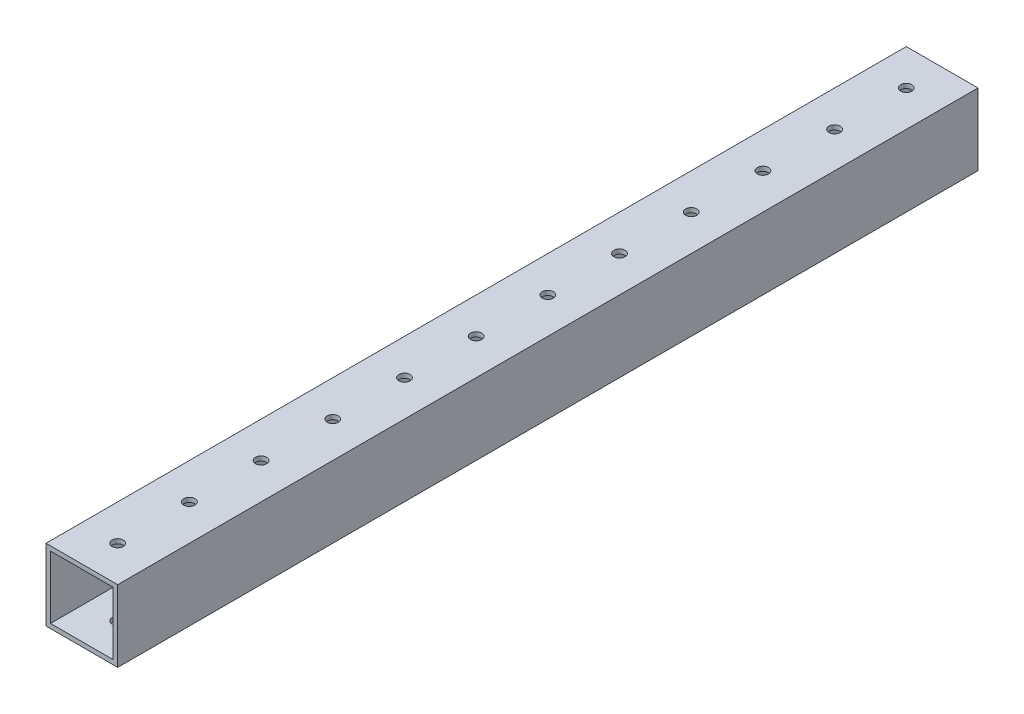
ISO-10303-21;
HEADER;
FILE_DESCRIPTION(('STEP AP214'),'2;1');
FILE_NAME('part.step','',(''),(''),'','','');
FILE_SCHEMA(('AUTOMOTIVE_DESIGN { 1 0 10303 214 1 1 1 1 }'));
ENDSEC;
DATA;
#1=APPLICATION_CONTEXT('core data for automotive mechanical design processes');
#2=APPLICATION_PROTOCOL_DEFINITION('international standard','automotive_design',2000,#1);
#3=PRODUCT_CONTEXT('',#1,'mechanical');
#4=PRODUCT('Part','Part','',(#3));
#5=PRODUCT_RELATED_PRODUCT_CATEGORY('part','',(#4));
#6=PRODUCT_DEFINITION_FORMATION('','',#4);
#7=PRODUCT_DEFINITION_CONTEXT('part definition',#1,'design');
#8=PRODUCT_DEFINITION('design','',#6,#7);
#9=PRODUCT_DEFINITION_SHAPE('','',#8);
#10=(LENGTH_UNIT() NAMED_UNIT(*) SI_UNIT(.MILLI.,.METRE.));
#11=(NAMED_UNIT(*) PLANE_ANGLE_UNIT() SI_UNIT($,.RADIAN.));
#12=(NAMED_UNIT(*) SI_UNIT($,.STERADIAN.) SOLID_ANGLE_UNIT());
#13=UNCERTAINTY_MEASURE_WITH_UNIT(LENGTH_MEASURE(1.E-05),#10,'distance_accuracy_value','');
#14=(GEOMETRIC_REPRESENTATION_CONTEXT(3) GLOBAL_UNCERTAINTY_ASSIGNED_CONTEXT((#13)) GLOBAL_UNIT_ASSIGNED_CONTEXT((#10,
#11,#12)) REPRESENTATION_CONTEXT('',''));
#15=CARTESIAN_POINT('',(0.,0.,0.));
#16=DIRECTION('',(0.,0.,1.));
#17=DIRECTION('',(1.,0.,0.));
#18=AXIS2_PLACEMENT_3D('',#15,#16,#17);
#19=CARTESIAN_POINT('',(0.,0.,304.8));
#20=DIRECTION('',(0.,0.,1.));
#21=DIRECTION('',(1.,0.,0.));
#22=AXIS2_PLACEMENT_3D('',#19,#20,#21);
#23=PLANE('',#22);
#24=DIRECTION('',(0.,1.,0.));
#25=VECTOR('',#24,1.);
#26=CARTESIAN_POINT('',(12.7,12.7,304.8));
#27=LINE('',#26,#25);
#28=CARTESIAN_POINT('',(12.7,-12.7,304.8));
#29=VERTEX_POINT('',#28);
#30=CARTESIAN_POINT('',(12.7,12.7,304.8));
#31=VERTEX_POINT('',#30);
#32=EDGE_CURVE('E138',#29,#31,#27,.T.);
#33=ORIENTED_EDGE('',*,*,#32,.T.);
#34=DIRECTION('',(-1.,0.,0.));
#35=VECTOR('',#34,1.);
#36=CARTESIAN_POINT('',(-12.7,12.7,304.8));
#37=LINE('',#36,#35);
#38=CARTESIAN_POINT('',(-12.7,12.7,304.8));
#39=VERTEX_POINT('',#38);
#40=EDGE_CURVE('E141',#31,#39,#37,.T.);
#41=ORIENTED_EDGE('',*,*,#40,.T.);
#42=DIRECTION('',(0.,-1.,0.));
#43=VECTOR('',#42,1.);
#44=CARTESIAN_POINT('',(-12.7,12.7,304.8));
#45=LINE('',#44,#43);
#46=CARTESIAN_POINT('',(-12.7,-12.7,304.8));
#47=VERTEX_POINT('',#46);
#48=EDGE_CURVE('E144',#39,#47,#45,.T.);
#49=ORIENTED_EDGE('',*,*,#48,.T.);
#50=DIRECTION('',(1.,0.,0.));
#51=VECTOR('',#50,1.);
#52=CARTESIAN_POINT('',(-12.7,-12.7,304.8));
#53=LINE('',#52,#51);
#54=EDGE_CURVE('E146',#47,#29,#53,.T.);
#55=ORIENTED_EDGE('',*,*,#54,.T.);
#56=EDGE_LOOP('',(#33,#41,#49,#55));
#57=FACE_BOUND('',#56,.T.);
#58=DIRECTION('',(-1.,0.,0.));
#59=VECTOR('',#58,1.);
#60=CARTESIAN_POINT('',(-11.1125,11.1125,304.8));
#61=LINE('',#60,#59);
#62=CARTESIAN_POINT('',(11.1125,11.1125,304.8));
#63=VERTEX_POINT('',#62);
#64=CARTESIAN_POINT('',(-11.1125,11.1125,304.8));
#65=VERTEX_POINT('',#64);
#66=EDGE_CURVE('E108',#63,#65,#61,.T.);
#67=ORIENTED_EDGE('',*,*,#66,.F.);
#68=DIRECTION('',(0.,1.,0.));
#69=VECTOR('',#68,1.);
#70=CARTESIAN_POINT('',(11.1125,11.1125,304.8));
#71=LINE('',#70,#69);
#72=CARTESIAN_POINT('',(11.1125,-11.1125,304.8));
#73=VERTEX_POINT('',#72);
#74=EDGE_CURVE('E100',#73,#63,#71,.T.);
#75=ORIENTED_EDGE('',*,*,#74,.F.);
#76=DIRECTION('',(1.,0.,0.));
#77=VECTOR('',#76,1.);
#78=CARTESIAN_POINT('',(-11.1125,-11.1125,304.8));
#79=LINE('',#78,#77);
#80=CARTESIAN_POINT('',(-11.1125,-11.1125,304.8));
#81=VERTEX_POINT('',#80);
#82=EDGE_CURVE('E122',#81,#73,#79,.T.);
#83=ORIENTED_EDGE('',*,*,#82,.F.);
#84=DIRECTION('',(0.,-1.,0.));
#85=VECTOR('',#84,1.);
#86=CARTESIAN_POINT('',(-11.1125,11.1125,304.8));
#87=LINE('',#86,#85);
#88=EDGE_CURVE('E120',#65,#81,#87,.T.);
#89=ORIENTED_EDGE('',*,*,#88,.F.);
#90=EDGE_LOOP('',(#67,#75,#83,#89));
#91=FACE_BOUND('',#90,.T.);
#92=ADVANCED_FACE('F33',(#57,#91),#23,.T.);
#93=CARTESIAN_POINT('',(0.,0.,0.));
#94=DIRECTION('',(0.,0.,1.));
#95=DIRECTION('',(1.,0.,0.));
#96=AXIS2_PLACEMENT_3D('',#93,#94,#95);
#97=PLANE('',#96);
#98=DIRECTION('',(0.,1.,0.));
#99=VECTOR('',#98,1.);
#100=CARTESIAN_POINT('',(12.7,12.7,0.));
#101=LINE('',#100,#99);
#102=CARTESIAN_POINT('',(12.7,-12.7,0.));
#103=VERTEX_POINT('',#102);
#104=CARTESIAN_POINT('',(12.7,12.7,0.));
#105=VERTEX_POINT('',#104);
#106=EDGE_CURVE('E116',#103,#105,#101,.T.);
#107=ORIENTED_EDGE('',*,*,#106,.F.);
#108=DIRECTION('',(1.,0.,0.));
#109=VECTOR('',#108,1.);
#110=CARTESIAN_POINT('',(-12.7,-12.7,0.));
#111=LINE('',#110,#109);
#112=CARTESIAN_POINT('',(-12.7,-12.7,0.));
#113=VERTEX_POINT('',#112);
#114=EDGE_CURVE('E142',#113,#103,#111,.T.);
#115=ORIENTED_EDGE('',*,*,#114,.F.);
#116=DIRECTION('',(0.,-1.,0.));
#117=VECTOR('',#116,1.);
#118=CARTESIAN_POINT('',(-12.7,12.7,0.));
#119=LINE('',#118,#117);
#120=CARTESIAN_POINT('',(-12.7,12.7,0.));
#121=VERTEX_POINT('',#120);
#122=EDGE_CURVE('E153',#121,#113,#119,.T.);
#123=ORIENTED_EDGE('',*,*,#122,.F.);
#124=DIRECTION('',(-1.,0.,0.));
#125=VECTOR('',#124,1.);
#126=CARTESIAN_POINT('',(-12.7,12.7,0.));
#127=LINE('',#126,#125);
#128=EDGE_CURVE('E151',#105,#121,#127,.T.);
#129=ORIENTED_EDGE('',*,*,#128,.F.);
#130=EDGE_LOOP('',(#107,#115,#123,#129));
#131=FACE_BOUND('',#130,.T.);
#132=DIRECTION('',(0.,1.,0.));
#133=VECTOR('',#132,1.);
#134=CARTESIAN_POINT('',(11.1125,11.1125,0.));
#135=LINE('',#134,#133);
#136=CARTESIAN_POINT('',(11.1125,-11.1125,0.));
#137=VERTEX_POINT('',#136);
#138=CARTESIAN_POINT('',(11.1125,11.1125,0.));
#139=VERTEX_POINT('',#138);
#140=EDGE_CURVE('E58',#137,#139,#135,.T.);
#141=ORIENTED_EDGE('',*,*,#140,.T.);
#142=DIRECTION('',(-1.,0.,0.));
#143=VECTOR('',#142,1.);
#144=CARTESIAN_POINT('',(-11.1125,11.1125,0.));
#145=LINE('',#144,#143);
#146=CARTESIAN_POINT('',(-11.1125,11.1125,0.));
#147=VERTEX_POINT('',#146);
#148=EDGE_CURVE('E115',#139,#147,#145,.T.);
#149=ORIENTED_EDGE('',*,*,#148,.T.);
#150=DIRECTION('',(0.,-1.,0.));
#151=VECTOR('',#150,1.);
#152=CARTESIAN_POINT('',(-11.1125,11.1125,0.));
#153=LINE('',#152,#151);
#154=CARTESIAN_POINT('',(-11.1125,-11.1125,0.));
#155=VERTEX_POINT('',#154);
#156=EDGE_CURVE('E130',#147,#155,#153,.T.);
#157=ORIENTED_EDGE('',*,*,#156,.T.);
#158=DIRECTION('',(1.,0.,0.));
#159=VECTOR('',#158,1.);
#160=CARTESIAN_POINT('',(-11.1125,-11.1125,0.));
#161=LINE('',#160,#159);
#162=EDGE_CURVE('E109',#155,#137,#161,.T.);
#163=ORIENTED_EDGE('',*,*,#162,.T.);
#164=EDGE_LOOP('',(#141,#149,#157,#163));
#165=FACE_BOUND('',#164,.T.);
#166=ADVANCED_FACE('F319',(#131,#165),#97,.F.);
#167=CARTESIAN_POINT('',(12.7,12.7,304.8));
#168=DIRECTION('',(-1.,0.,0.));
#169=DIRECTION('',(0.,-1.,0.));
#170=AXIS2_PLACEMENT_3D('',#167,#168,#169);
#171=PLANE('',#170);
#172=ORIENTED_EDGE('',*,*,#106,.T.);
#173=DIRECTION('',(0.,0.,-1.));
#174=VECTOR('',#173,1.);
#175=CARTESIAN_POINT('',(12.7,12.7,304.8));
#176=LINE('',#175,#174);
#177=EDGE_CURVE('E11',#31,#105,#176,.T.);
#178=ORIENTED_EDGE('',*,*,#177,.F.);
#179=ORIENTED_EDGE('',*,*,#32,.F.);
#180=DIRECTION('',(0.,0.,-1.));
#181=VECTOR('',#180,1.);
#182=CARTESIAN_POINT('',(12.7,-12.7,304.8));
#183=LINE('',#182,#181);
#184=EDGE_CURVE('E148',#29,#103,#183,.T.);
#185=ORIENTED_EDGE('',*,*,#184,.T.);
#186=EDGE_LOOP('',(#172,#178,#179,#185));
#187=FACE_BOUND('',#186,.T.);
#188=ADVANCED_FACE('F35',(#187),#171,.F.);
#189=CARTESIAN_POINT('',(-12.7,12.7,304.8));
#190=DIRECTION('',(0.,-1.,0.));
#191=DIRECTION('',(0.,0.,-1.));
#192=AXIS2_PLACEMENT_3D('',#189,#190,#191);
#193=PLANE('',#192);
#194=CARTESIAN_POINT('',(-9.75519886072772E-13,12.7,12.7));
#195=DIRECTION('',(0.,1.,0.));
#196=DIRECTION('',(0.,0.,1.));
#197=AXIS2_PLACEMENT_3D('',#194,#195,#196);
#198=CIRCLE('',#197,1.984375);
#199=CARTESIAN_POINT('',(-9.75519886072772E-13,12.7,14.684375));
#200=VERTEX_POINT('',#199);
#201=EDGE_CURVE('E344',#200,#200,#198,.T.);
#202=ORIENTED_EDGE('',*,*,#201,.F.);
#203=EDGE_LOOP('',(#202));
#204=FACE_BOUND('',#203,.T.);
#205=CARTESIAN_POINT('',(-8.86836260066156E-13,12.7,38.1));
#206=DIRECTION('',(0.,1.,0.));
#207=DIRECTION('',(0.,0.,1.));
#208=AXIS2_PLACEMENT_3D('',#205,#206,#207);
#209=CIRCLE('',#208,1.984375);
#210=CARTESIAN_POINT('',(-8.86836260066156E-13,12.7,40.084375));
#211=VERTEX_POINT('',#210);
#212=EDGE_CURVE('E221',#211,#211,#209,.T.);
#213=ORIENTED_EDGE('',*,*,#212,.F.);
#214=EDGE_LOOP('',(#213));
#215=FACE_BOUND('',#214,.T.);
#216=CARTESIAN_POINT('',(-7.9815263405954E-13,12.7,63.5));
#217=DIRECTION('',(0.,1.,0.));
#218=DIRECTION('',(0.,0.,1.));
#219=AXIS2_PLACEMENT_3D('',#216,#217,#218);
#220=CIRCLE('',#219,1.984375);
#221=CARTESIAN_POINT('',(-7.9815263405954E-13,12.7,65.484375));
#222=VERTEX_POINT('',#221);
#223=EDGE_CURVE('E218',#222,#222,#220,.T.);
#224=ORIENTED_EDGE('',*,*,#223,.F.);
#225=EDGE_LOOP('',(#224));
#226=FACE_BOUND('',#225,.T.);
#227=CARTESIAN_POINT('',(-7.09469008052925E-13,12.7,88.9));
#228=DIRECTION('',(0.,1.,0.));
#229=DIRECTION('',(0.,0.,1.));
#230=AXIS2_PLACEMENT_3D('',#227,#228,#229);
#231=CIRCLE('',#230,1.984375);
#232=CARTESIAN_POINT('',(-7.09469008052925E-13,12.7,90.884375));
#233=VERTEX_POINT('',#232);
#234=EDGE_CURVE('E237',#233,#233,#231,.T.);
#235=ORIENTED_EDGE('',*,*,#234,.F.);
#236=EDGE_LOOP('',(#235));
#237=FACE_BOUND('',#236,.T.);
#238=CARTESIAN_POINT('',(-6.20785382046309E-13,12.7,114.3));
#239=DIRECTION('',(0.,1.,0.));
#240=DIRECTION('',(0.,0.,1.));
#241=AXIS2_PLACEMENT_3D('',#238,#239,#240);
#242=CIRCLE('',#241,1.984375);
#243=CARTESIAN_POINT('',(-6.20785382046309E-13,12.7,116.284375));
#244=VERTEX_POINT('',#243);
#245=EDGE_CURVE('E244',#244,#244,#242,.T.);
#246=ORIENTED_EDGE('',*,*,#245,.F.);
#247=EDGE_LOOP('',(#246));
#248=FACE_BOUND('',#247,.T.);
#249=CARTESIAN_POINT('',(-5.32101756039693E-13,12.7,139.7));
#250=DIRECTION('',(0.,1.,0.));
#251=DIRECTION('',(0.,0.,1.));
#252=AXIS2_PLACEMENT_3D('',#249,#250,#251);
#253=CIRCLE('',#252,1.984375);
#254=CARTESIAN_POINT('',(-5.32101756039693E-13,12.7,141.684375));
#255=VERTEX_POINT('',#254);
#256=EDGE_CURVE('E251',#255,#255,#253,.T.);
#257=ORIENTED_EDGE('',*,*,#256,.F.);
#258=EDGE_LOOP('',(#257));
#259=FACE_BOUND('',#258,.T.);
#260=CARTESIAN_POINT('',(-4.43418130033078E-13,12.7,165.1));
#261=DIRECTION('',(0.,1.,0.));
#262=DIRECTION('',(0.,0.,1.));
#263=AXIS2_PLACEMENT_3D('',#260,#261,#262);
#264=CIRCLE('',#263,1.984375);
#265=CARTESIAN_POINT('',(-4.43418130033078E-13,12.7,167.084375));
#266=VERTEX_POINT('',#265);
#267=EDGE_CURVE('E258',#266,#266,#264,.T.);
#268=ORIENTED_EDGE('',*,*,#267,.F.);
#269=EDGE_LOOP('',(#268));
#270=FACE_BOUND('',#269,.T.);
#271=CARTESIAN_POINT('',(-3.54734504026462E-13,12.7,190.5));
#272=DIRECTION('',(0.,1.,0.));
#273=DIRECTION('',(0.,0.,1.));
#274=AXIS2_PLACEMENT_3D('',#271,#272,#273);
#275=CIRCLE('',#274,1.984375);
#276=CARTESIAN_POINT('',(-3.54734504026462E-13,12.7,192.484375));
#277=VERTEX_POINT('',#276);
#278=EDGE_CURVE('E265',#277,#277,#275,.T.);
#279=ORIENTED_EDGE('',*,*,#278,.F.);
#280=EDGE_LOOP('',(#279));
#281=FACE_BOUND('',#280,.T.);
#282=CARTESIAN_POINT('',(-2.66050878019847E-13,12.7,215.9));
#283=DIRECTION('',(0.,1.,0.));
#284=DIRECTION('',(0.,0.,1.));
#285=AXIS2_PLACEMENT_3D('',#282,#283,#284);
#286=CIRCLE('',#285,1.984375);
#287=CARTESIAN_POINT('',(-2.66050878019847E-13,12.7,217.884375));
#288=VERTEX_POINT('',#287);
#289=EDGE_CURVE('E272',#288,#288,#286,.T.);
#290=ORIENTED_EDGE('',*,*,#289,.F.);
#291=EDGE_LOOP('',(#290));
#292=FACE_BOUND('',#291,.T.);
#293=CARTESIAN_POINT('',(-1.77367252013231E-13,12.7,241.3));
#294=DIRECTION('',(0.,1.,0.));
#295=DIRECTION('',(0.,0.,1.));
#296=AXIS2_PLACEMENT_3D('',#293,#294,#295);
#297=CIRCLE('',#296,1.984375);
#298=CARTESIAN_POINT('',(-1.77367252013231E-13,12.7,243.284375));
#299=VERTEX_POINT('',#298);
#300=EDGE_CURVE('E279',#299,#299,#297,.T.);
#301=ORIENTED_EDGE('',*,*,#300,.F.);
#302=EDGE_LOOP('',(#301));
#303=FACE_BOUND('',#302,.T.);
#304=CARTESIAN_POINT('',(0.,12.7,266.7));
#305=DIRECTION('',(0.,1.,0.));
#306=DIRECTION('',(0.,0.,1.));
#307=AXIS2_PLACEMENT_3D('',#304,#305,#306);
#308=CIRCLE('',#307,1.984375);
#309=CARTESIAN_POINT('',(0.,12.7,268.684375));
#310=VERTEX_POINT('',#309);
#311=EDGE_CURVE('E286',#310,#310,#308,.T.);
#312=ORIENTED_EDGE('',*,*,#311,.F.);
#313=EDGE_LOOP('',(#312));
#314=FACE_BOUND('',#313,.T.);
#315=CARTESIAN_POINT('',(0.,12.7,292.1));
#316=DIRECTION('',(0.,1.,0.));
#317=DIRECTION('',(0.,0.,1.));
#318=AXIS2_PLACEMENT_3D('',#315,#316,#317);
#319=CIRCLE('',#318,1.984375);
#320=CARTESIAN_POINT('',(0.,12.7,294.084375));
#321=VERTEX_POINT('',#320);
#322=EDGE_CURVE('E293',#321,#321,#319,.T.);
#323=ORIENTED_EDGE('',*,*,#322,.F.);
#324=EDGE_LOOP('',(#323));
#325=FACE_BOUND('',#324,.T.);
#326=ORIENTED_EDGE('',*,*,#128,.T.);
#327=DIRECTION('',(0.,0.,-1.));
#328=VECTOR('',#327,1.);
#329=CARTESIAN_POINT('',(-12.7,12.7,304.8));
#330=LINE('',#329,#328);
#331=EDGE_CURVE('E42',#39,#121,#330,.T.);
#332=ORIENTED_EDGE('',*,*,#331,.F.);
#333=ORIENTED_EDGE('',*,*,#40,.F.);
#334=ORIENTED_EDGE('',*,*,#177,.T.);
#335=EDGE_LOOP('',(#326,#332,#333,#334));
#336=FACE_BOUND('',#335,.T.);
#337=ADVANCED_FACE('F333',(#204,#215,#226,#237,#248,#259,#270,#281,#292,#303,#314,#325,#336),
#193,.F.);
#338=CARTESIAN_POINT('',(-12.7,12.7,304.8));
#339=DIRECTION('',(1.,0.,0.));
#340=DIRECTION('',(0.,1.,0.));
#341=AXIS2_PLACEMENT_3D('',#338,#339,#340);
#342=PLANE('',#341);
#343=ORIENTED_EDGE('',*,*,#122,.T.);
#344=DIRECTION('',(0.,0.,-1.));
#345=VECTOR('',#344,1.);
#346=CARTESIAN_POINT('',(-12.7,-12.7,304.8));
#347=LINE('',#346,#345);
#348=EDGE_CURVE('E158',#47,#113,#347,.T.);
#349=ORIENTED_EDGE('',*,*,#348,.F.);
#350=ORIENTED_EDGE('',*,*,#48,.F.);
#351=ORIENTED_EDGE('',*,*,#331,.T.);
#352=EDGE_LOOP('',(#343,#349,#350,#351));
#353=FACE_BOUND('',#352,.T.);
#354=ADVANCED_FACE('F330',(#353),#342,.F.);
#355=CARTESIAN_POINT('',(-12.7,-12.7,304.8));
#356=DIRECTION('',(0.,1.,0.));
#357=DIRECTION('',(0.,0.,1.));
#358=AXIS2_PLACEMENT_3D('',#355,#356,#357);
#359=PLANE('',#358);
#360=CARTESIAN_POINT('',(-9.75519886072772E-13,-12.7,12.7));
#361=DIRECTION('',(0.,1.,0.));
#362=DIRECTION('',(0.,0.,1.));
#363=AXIS2_PLACEMENT_3D('',#360,#361,#362);
#364=CIRCLE('',#363,1.984375);
#365=CARTESIAN_POINT('',(-9.75519886072772E-13,-12.7,14.684375));
#366=VERTEX_POINT('',#365);
#367=EDGE_CURVE('E455',#366,#366,#364,.T.);
#368=ORIENTED_EDGE('',*,*,#367,.T.);
#369=EDGE_LOOP('',(#368));
#370=FACE_BOUND('',#369,.T.);
#371=CARTESIAN_POINT('',(-8.86836260066156E-13,-12.7,38.1));
#372=DIRECTION('',(0.,1.,0.));
#373=DIRECTION('',(0.,0.,1.));
#374=AXIS2_PLACEMENT_3D('',#371,#372,#373);
#375=CIRCLE('',#374,1.984375);
#376=CARTESIAN_POINT('',(-8.86836260066156E-13,-12.7,40.084375));
#377=VERTEX_POINT('',#376);
#378=EDGE_CURVE('E214',#377,#377,#375,.T.);
#379=ORIENTED_EDGE('',*,*,#378,.T.);
#380=EDGE_LOOP('',(#379));
#381=FACE_BOUND('',#380,.T.);
#382=CARTESIAN_POINT('',(-7.9815263405954E-13,-12.7,63.5));
#383=DIRECTION('',(0.,1.,0.));
#384=DIRECTION('',(0.,0.,1.));
#385=AXIS2_PLACEMENT_3D('',#382,#383,#384);
#386=CIRCLE('',#385,1.984375);
#387=CARTESIAN_POINT('',(-7.9815263405954E-13,-12.7,65.484375));
#388=VERTEX_POINT('',#387);
#389=EDGE_CURVE('E210',#388,#388,#386,.T.);
#390=ORIENTED_EDGE('',*,*,#389,.T.);
#391=EDGE_LOOP('',(#390));
#392=FACE_BOUND('',#391,.T.);
#393=CARTESIAN_POINT('',(-7.09469008052925E-13,-12.7,88.9));
#394=DIRECTION('',(0.,1.,0.));
#395=DIRECTION('',(0.,0.,1.));
#396=AXIS2_PLACEMENT_3D('',#393,#394,#395);
#397=CIRCLE('',#396,1.984375);
#398=CARTESIAN_POINT('',(-7.09469008052925E-13,-12.7,90.884375));
#399=VERTEX_POINT('',#398);
#400=EDGE_CURVE('E206',#399,#399,#397,.T.);
#401=ORIENTED_EDGE('',*,*,#400,.T.);
#402=EDGE_LOOP('',(#401));
#403=FACE_BOUND('',#402,.T.);
#404=CARTESIAN_POINT('',(-6.20785382046309E-13,-12.7,114.3));
#405=DIRECTION('',(0.,1.,0.));
#406=DIRECTION('',(0.,0.,1.));
#407=AXIS2_PLACEMENT_3D('',#404,#405,#406);
#408=CIRCLE('',#407,1.984375);
#409=CARTESIAN_POINT('',(-6.20785382046309E-13,-12.7,116.284375));
#410=VERTEX_POINT('',#409);
#411=EDGE_CURVE('E201',#410,#410,#408,.T.);
#412=ORIENTED_EDGE('',*,*,#411,.T.);
#413=EDGE_LOOP('',(#412));
#414=FACE_BOUND('',#413,.T.);
#415=CARTESIAN_POINT('',(-5.32101756039693E-13,-12.7,139.7));
#416=DIRECTION('',(0.,1.,0.));
#417=DIRECTION('',(0.,0.,1.));
#418=AXIS2_PLACEMENT_3D('',#415,#416,#417);
#419=CIRCLE('',#418,1.984375);
#420=CARTESIAN_POINT('',(-5.32101756039693E-13,-12.7,141.684375));
#421=VERTEX_POINT('',#420);
#422=EDGE_CURVE('E196',#421,#421,#419,.T.);
#423=ORIENTED_EDGE('',*,*,#422,.T.);
#424=EDGE_LOOP('',(#423));
#425=FACE_BOUND('',#424,.T.);
#426=CARTESIAN_POINT('',(-4.43418130033078E-13,-12.7,165.1));
#427=DIRECTION('',(0.,1.,0.));
#428=DIRECTION('',(0.,0.,1.));
#429=AXIS2_PLACEMENT_3D('',#426,#427,#428);
#430=CIRCLE('',#429,1.984375);
#431=CARTESIAN_POINT('',(-4.43418130033078E-13,-12.7,167.084375));
#432=VERTEX_POINT('',#431);
#433=EDGE_CURVE('E191',#432,#432,#430,.T.);
#434=ORIENTED_EDGE('',*,*,#433,.T.);
#435=EDGE_LOOP('',(#434));
#436=FACE_BOUND('',#435,.T.);
#437=CARTESIAN_POINT('',(-3.54734504026462E-13,-12.7,190.5));
#438=DIRECTION('',(0.,1.,0.));
#439=DIRECTION('',(0.,0.,1.));
#440=AXIS2_PLACEMENT_3D('',#437,#438,#439);
#441=CIRCLE('',#440,1.984375);
#442=CARTESIAN_POINT('',(-3.54734504026462E-13,-12.7,192.484375));
#443=VERTEX_POINT('',#442);
#444=EDGE_CURVE('E186',#443,#443,#441,.T.);
#445=ORIENTED_EDGE('',*,*,#444,.T.);
#446=EDGE_LOOP('',(#445));
#447=FACE_BOUND('',#446,.T.);
#448=CARTESIAN_POINT('',(-2.66050878019847E-13,-12.7,215.9));
#449=DIRECTION('',(0.,1.,0.));
#450=DIRECTION('',(0.,0.,1.));
#451=AXIS2_PLACEMENT_3D('',#448,#449,#450);
#452=CIRCLE('',#451,1.984375);
#453=CARTESIAN_POINT('',(-2.66050878019847E-13,-12.7,217.884375));
#454=VERTEX_POINT('',#453);
#455=EDGE_CURVE('E181',#454,#454,#452,.T.);
#456=ORIENTED_EDGE('',*,*,#455,.T.);
#457=EDGE_LOOP('',(#456));
#458=FACE_BOUND('',#457,.T.);
#459=CARTESIAN_POINT('',(-1.77367252013231E-13,-12.7,241.3));
#460=DIRECTION('',(0.,1.,0.));
#461=DIRECTION('',(0.,0.,1.));
#462=AXIS2_PLACEMENT_3D('',#459,#460,#461);
#463=CIRCLE('',#462,1.984375);
#464=CARTESIAN_POINT('',(-1.77367252013231E-13,-12.7,243.284375));
#465=VERTEX_POINT('',#464);
#466=EDGE_CURVE('E176',#465,#465,#463,.T.);
#467=ORIENTED_EDGE('',*,*,#466,.T.);
#468=EDGE_LOOP('',(#467));
#469=FACE_BOUND('',#468,.T.);
#470=CARTESIAN_POINT('',(0.,-12.7,266.7));
#471=DIRECTION('',(0.,1.,0.));
#472=DIRECTION('',(0.,0.,1.));
#473=AXIS2_PLACEMENT_3D('',#470,#471,#472);
#474=CIRCLE('',#473,1.984375);
#475=CARTESIAN_POINT('',(0.,-12.7,268.684375));
#476=VERTEX_POINT('',#475);
#477=EDGE_CURVE('E171',#476,#476,#474,.T.);
#478=ORIENTED_EDGE('',*,*,#477,.T.);
#479=EDGE_LOOP('',(#478));
#480=FACE_BOUND('',#479,.T.);
#481=CARTESIAN_POINT('',(0.,-12.7,292.1));
#482=DIRECTION('',(0.,1.,0.));
#483=DIRECTION('',(0.,0.,1.));
#484=AXIS2_PLACEMENT_3D('',#481,#482,#483);
#485=CIRCLE('',#484,1.984375);
#486=CARTESIAN_POINT('',(0.,-12.7,294.084375));
#487=VERTEX_POINT('',#486);
#488=EDGE_CURVE('E166',#487,#487,#485,.T.);
#489=ORIENTED_EDGE('',*,*,#488,.T.);
#490=EDGE_LOOP('',(#489));
#491=FACE_BOUND('',#490,.T.);
#492=ORIENTED_EDGE('',*,*,#114,.T.);
#493=ORIENTED_EDGE('',*,*,#184,.F.);
#494=ORIENTED_EDGE('',*,*,#54,.F.);
#495=ORIENTED_EDGE('',*,*,#348,.T.);
#496=EDGE_LOOP('',(#492,#493,#494,#495));
#497=FACE_BOUND('',#496,.T.);
#498=ADVANCED_FACE('F314',(#370,#381,#392,#403,#414,#425,#436,#447,#458,#469,#480,#491,#497),
#359,.F.);
#499=CARTESIAN_POINT('',(11.1125,11.1125,304.8));
#500=DIRECTION('',(-1.,0.,0.));
#501=DIRECTION('',(0.,0.,1.));
#502=AXIS2_PLACEMENT_3D('',#499,#500,#501);
#503=PLANE('',#502);
#504=ORIENTED_EDGE('',*,*,#140,.F.);
#505=DIRECTION('',(0.,0.,-1.));
#506=VECTOR('',#505,1.);
#507=CARTESIAN_POINT('',(11.1125,-11.1125,304.8));
#508=LINE('',#507,#506);
#509=EDGE_CURVE('E104',#73,#137,#508,.T.);
#510=ORIENTED_EDGE('',*,*,#509,.F.);
#511=ORIENTED_EDGE('',*,*,#74,.T.);
#512=DIRECTION('',(0.,0.,-1.));
#513=VECTOR('',#512,1.);
#514=CARTESIAN_POINT('',(11.1125,11.1125,304.8));
#515=LINE('',#514,#513);
#516=EDGE_CURVE('E103',#63,#139,#515,.T.);
#517=ORIENTED_EDGE('',*,*,#516,.T.);
#518=EDGE_LOOP('',(#504,#510,#511,#517));
#519=FACE_BOUND('',#518,.T.);
#520=ADVANCED_FACE('F102',(#519),#503,.T.);
#521=CARTESIAN_POINT('',(-11.1125,11.1125,304.8));
#522=DIRECTION('',(0.,-1.,0.));
#523=DIRECTION('',(0.,0.,-1.));
#524=AXIS2_PLACEMENT_3D('',#521,#522,#523);
#525=PLANE('',#524);
#526=CARTESIAN_POINT('',(-9.75519886072772E-13,11.1125,12.7));
#527=DIRECTION('',(0.,-1.,0.));
#528=DIRECTION('',(0.,0.,-1.));
#529=AXIS2_PLACEMENT_3D('',#526,#527,#528);
#530=CIRCLE('',#529,1.984375);
#531=CARTESIAN_POINT('',(-9.75519886072772E-13,11.1125,10.715625));
#532=VERTEX_POINT('',#531);
#533=EDGE_CURVE('E226',#532,#532,#530,.T.);
#534=ORIENTED_EDGE('',*,*,#533,.F.);
#535=EDGE_LOOP('',(#534));
#536=FACE_BOUND('',#535,.T.);
#537=CARTESIAN_POINT('',(-8.86836260066156E-13,11.1125,38.1));
#538=DIRECTION('',(0.,-1.,0.));
#539=DIRECTION('',(0.,0.,-1.));
#540=AXIS2_PLACEMENT_3D('',#537,#538,#539);
#541=CIRCLE('',#540,1.984375);
#542=CARTESIAN_POINT('',(-8.86836260066156E-13,11.1125,36.115625));
#543=VERTEX_POINT('',#542);
#544=EDGE_CURVE('E213',#543,#543,#541,.T.);
#545=ORIENTED_EDGE('',*,*,#544,.F.);
#546=EDGE_LOOP('',(#545));
#547=FACE_BOUND('',#546,.T.);
#548=CARTESIAN_POINT('',(-7.9815263405954E-13,11.1125,63.5));
#549=DIRECTION('',(0.,-1.,0.));
#550=DIRECTION('',(0.,0.,-1.));
#551=AXIS2_PLACEMENT_3D('',#548,#549,#550);
#552=CIRCLE('',#551,1.984375);
#553=CARTESIAN_POINT('',(-7.9815263405954E-13,11.1125,61.515625));
#554=VERTEX_POINT('',#553);
#555=EDGE_CURVE('E209',#554,#554,#552,.T.);
#556=ORIENTED_EDGE('',*,*,#555,.F.);
#557=EDGE_LOOP('',(#556));
#558=FACE_BOUND('',#557,.T.);
#559=CARTESIAN_POINT('',(-7.09469008052925E-13,11.1125,88.9));
#560=DIRECTION('',(0.,-1.,0.));
#561=DIRECTION('',(0.,0.,-1.));
#562=AXIS2_PLACEMENT_3D('',#559,#560,#561);
#563=CIRCLE('',#562,1.984375);
#564=CARTESIAN_POINT('',(-7.09469008052925E-13,11.1125,86.915625));
#565=VERTEX_POINT('',#564);
#566=EDGE_CURVE('E205',#565,#565,#563,.T.);
#567=ORIENTED_EDGE('',*,*,#566,.F.);
#568=EDGE_LOOP('',(#567));
#569=FACE_BOUND('',#568,.T.);
#570=CARTESIAN_POINT('',(-6.20785382046309E-13,11.1125,114.3));
#571=DIRECTION('',(0.,-1.,0.));
#572=DIRECTION('',(0.,0.,-1.));
#573=AXIS2_PLACEMENT_3D('',#570,#571,#572);
#574=CIRCLE('',#573,1.984375);
#575=CARTESIAN_POINT('',(-6.20785382046309E-13,11.1125,112.315625));
#576=VERTEX_POINT('',#575);
#577=EDGE_CURVE('E200',#576,#576,#574,.T.);
#578=ORIENTED_EDGE('',*,*,#577,.F.);
#579=EDGE_LOOP('',(#578));
#580=FACE_BOUND('',#579,.T.);
#581=CARTESIAN_POINT('',(-5.32101756039693E-13,11.1125,139.7));
#582=DIRECTION('',(0.,-1.,0.));
#583=DIRECTION('',(0.,0.,-1.));
#584=AXIS2_PLACEMENT_3D('',#581,#582,#583);
#585=CIRCLE('',#584,1.984375);
#586=CARTESIAN_POINT('',(-5.32101756039693E-13,11.1125,137.715625));
#587=VERTEX_POINT('',#586);
#588=EDGE_CURVE('E195',#587,#587,#585,.T.);
#589=ORIENTED_EDGE('',*,*,#588,.F.);
#590=EDGE_LOOP('',(#589));
#591=FACE_BOUND('',#590,.T.);
#592=CARTESIAN_POINT('',(-4.43418130033078E-13,11.1125,165.1));
#593=DIRECTION('',(0.,-1.,0.));
#594=DIRECTION('',(0.,0.,-1.));
#595=AXIS2_PLACEMENT_3D('',#592,#593,#594);
#596=CIRCLE('',#595,1.984375);
#597=CARTESIAN_POINT('',(-4.43418130033078E-13,11.1125,163.115625));
#598=VERTEX_POINT('',#597);
#599=EDGE_CURVE('E190',#598,#598,#596,.T.);
#600=ORIENTED_EDGE('',*,*,#599,.F.);
#601=EDGE_LOOP('',(#600));
#602=FACE_BOUND('',#601,.T.);
#603=CARTESIAN_POINT('',(-3.54734504026462E-13,11.1125,190.5));
#604=DIRECTION('',(0.,-1.,0.));
#605=DIRECTION('',(0.,0.,-1.));
#606=AXIS2_PLACEMENT_3D('',#603,#604,#605);
#607=CIRCLE('',#606,1.984375);
#608=CARTESIAN_POINT('',(-3.54734504026462E-13,11.1125,188.515625));
#609=VERTEX_POINT('',#608);
#610=EDGE_CURVE('E185',#609,#609,#607,.T.);
#611=ORIENTED_EDGE('',*,*,#610,.F.);
#612=EDGE_LOOP('',(#611));
#613=FACE_BOUND('',#612,.T.);
#614=CARTESIAN_POINT('',(-2.66050878019847E-13,11.1125,215.9));
#615=DIRECTION('',(0.,-1.,0.));
#616=DIRECTION('',(0.,0.,-1.));
#617=AXIS2_PLACEMENT_3D('',#614,#615,#616);
#618=CIRCLE('',#617,1.984375);
#619=CARTESIAN_POINT('',(-2.66050878019847E-13,11.1125,213.915625));
#620=VERTEX_POINT('',#619);
#621=EDGE_CURVE('E180',#620,#620,#618,.T.);
#622=ORIENTED_EDGE('',*,*,#621,.F.);
#623=EDGE_LOOP('',(#622));
#624=FACE_BOUND('',#623,.T.);
#625=CARTESIAN_POINT('',(-1.77367252013231E-13,11.1125,241.3));
#626=DIRECTION('',(0.,-1.,0.));
#627=DIRECTION('',(0.,0.,-1.));
#628=AXIS2_PLACEMENT_3D('',#625,#626,#627);
#629=CIRCLE('',#628,1.984375);
#630=CARTESIAN_POINT('',(-1.77367252013231E-13,11.1125,239.315625));
#631=VERTEX_POINT('',#630);
#632=EDGE_CURVE('E175',#631,#631,#629,.T.);
#633=ORIENTED_EDGE('',*,*,#632,.F.);
#634=EDGE_LOOP('',(#633));
#635=FACE_BOUND('',#634,.T.);
#636=CARTESIAN_POINT('',(0.,11.1125,266.7));
#637=DIRECTION('',(0.,-1.,0.));
#638=DIRECTION('',(0.,0.,-1.));
#639=AXIS2_PLACEMENT_3D('',#636,#637,#638);
#640=CIRCLE('',#639,1.984375);
#641=CARTESIAN_POINT('',(0.,11.1125,264.715625));
#642=VERTEX_POINT('',#641);
#643=EDGE_CURVE('E170',#642,#642,#640,.T.);
#644=ORIENTED_EDGE('',*,*,#643,.F.);
#645=EDGE_LOOP('',(#644));
#646=FACE_BOUND('',#645,.T.);
#647=CARTESIAN_POINT('',(0.,11.1125,292.1));
#648=DIRECTION('',(0.,-1.,0.));
#649=DIRECTION('',(0.,0.,-1.));
#650=AXIS2_PLACEMENT_3D('',#647,#648,#649);
#651=CIRCLE('',#650,1.984375);
#652=CARTESIAN_POINT('',(0.,11.1125,290.115625));
#653=VERTEX_POINT('',#652);
#654=EDGE_CURVE('E128',#653,#653,#651,.T.);
#655=ORIENTED_EDGE('',*,*,#654,.F.);
#656=EDGE_LOOP('',(#655));
#657=FACE_BOUND('',#656,.T.);
#658=ORIENTED_EDGE('',*,*,#148,.F.);
#659=ORIENTED_EDGE('',*,*,#516,.F.);
#660=ORIENTED_EDGE('',*,*,#66,.T.);
#661=DIRECTION('',(0.,0.,-1.));
#662=VECTOR('',#661,1.);
#663=CARTESIAN_POINT('',(-11.1125,11.1125,304.8));
#664=LINE('',#663,#662);
#665=EDGE_CURVE('E117',#65,#147,#664,.T.);
#666=ORIENTED_EDGE('',*,*,#665,.T.);
#667=EDGE_LOOP('',(#658,#659,#660,#666));
#668=FACE_BOUND('',#667,.T.);
#669=ADVANCED_FACE('F112',(#536,#547,#558,#569,#580,#591,#602,#613,#624,#635,#646,#657,#668),
#525,.T.);
#670=CARTESIAN_POINT('',(-11.1125,11.1125,304.8));
#671=DIRECTION('',(1.,0.,0.));
#672=DIRECTION('',(0.,1.,0.));
#673=AXIS2_PLACEMENT_3D('',#670,#671,#672);
#674=PLANE('',#673);
#675=ORIENTED_EDGE('',*,*,#156,.F.);
#676=ORIENTED_EDGE('',*,*,#665,.F.);
#677=ORIENTED_EDGE('',*,*,#88,.T.);
#678=DIRECTION('',(0.,0.,-1.));
#679=VECTOR('',#678,1.);
#680=CARTESIAN_POINT('',(-11.1125,-11.1125,304.8));
#681=LINE('',#680,#679);
#682=EDGE_CURVE('E50',#81,#155,#681,.T.);
#683=ORIENTED_EDGE('',*,*,#682,.T.);
#684=EDGE_LOOP('',(#675,#676,#677,#683));
#685=FACE_BOUND('',#684,.T.);
#686=ADVANCED_FACE('F304',(#685),#674,.T.);
#687=CARTESIAN_POINT('',(-11.1125,-11.1125,304.8));
#688=DIRECTION('',(0.,1.,0.));
#689=DIRECTION('',(0.,0.,1.));
#690=AXIS2_PLACEMENT_3D('',#687,#688,#689);
#691=PLANE('',#690);
#692=CARTESIAN_POINT('',(-9.75519886072772E-13,-11.1125,12.7));
#693=DIRECTION('',(0.,1.,0.));
#694=DIRECTION('',(0.,0.,1.));
#695=AXIS2_PLACEMENT_3D('',#692,#693,#694);
#696=CIRCLE('',#695,1.984375);
#697=CARTESIAN_POINT('',(-9.75519886072772E-13,-11.1125,14.684375));
#698=VERTEX_POINT('',#697);
#699=EDGE_CURVE('E37',#698,#698,#696,.T.);
#700=ORIENTED_EDGE('',*,*,#699,.F.);
#701=EDGE_LOOP('',(#700));
#702=FACE_BOUND('',#701,.T.);
#703=CARTESIAN_POINT('',(-8.86836260066156E-13,-11.1125,38.1));
#704=DIRECTION('',(0.,1.,0.));
#705=DIRECTION('',(0.,0.,1.));
#706=AXIS2_PLACEMENT_3D('',#703,#704,#705);
#707=CIRCLE('',#706,1.984375);
#708=CARTESIAN_POINT('',(-8.86836260066156E-13,-11.1125,40.084375));
#709=VERTEX_POINT('',#708);
#710=EDGE_CURVE('E211',#709,#709,#707,.T.);
#711=ORIENTED_EDGE('',*,*,#710,.F.);
#712=EDGE_LOOP('',(#711));
#713=FACE_BOUND('',#712,.T.);
#714=CARTESIAN_POINT('',(-7.9815263405954E-13,-11.1125,63.5));
#715=DIRECTION('',(0.,1.,0.));
#716=DIRECTION('',(0.,0.,1.));
#717=AXIS2_PLACEMENT_3D('',#714,#715,#716);
#718=CIRCLE('',#717,1.984375);
#719=CARTESIAN_POINT('',(-7.9815263405954E-13,-11.1125,65.484375));
#720=VERTEX_POINT('',#719);
#721=EDGE_CURVE('E207',#720,#720,#718,.T.);
#722=ORIENTED_EDGE('',*,*,#721,.F.);
#723=EDGE_LOOP('',(#722));
#724=FACE_BOUND('',#723,.T.);
#725=CARTESIAN_POINT('',(-7.09469008052925E-13,-11.1125,88.9));
#726=DIRECTION('',(0.,1.,0.));
#727=DIRECTION('',(0.,0.,1.));
#728=AXIS2_PLACEMENT_3D('',#725,#726,#727);
#729=CIRCLE('',#728,1.984375);
#730=CARTESIAN_POINT('',(-7.09469008052925E-13,-11.1125,90.884375));
#731=VERTEX_POINT('',#730);
#732=EDGE_CURVE('E202',#731,#731,#729,.T.);
#733=ORIENTED_EDGE('',*,*,#732,.F.);
#734=EDGE_LOOP('',(#733));
#735=FACE_BOUND('',#734,.T.);
#736=CARTESIAN_POINT('',(-6.20785382046309E-13,-11.1125,114.3));
#737=DIRECTION('',(0.,1.,0.));
#738=DIRECTION('',(0.,0.,1.));
#739=AXIS2_PLACEMENT_3D('',#736,#737,#738);
#740=CIRCLE('',#739,1.984375);
#741=CARTESIAN_POINT('',(-6.20785382046309E-13,-11.1125,116.284375));
#742=VERTEX_POINT('',#741);
#743=EDGE_CURVE('E197',#742,#742,#740,.T.);
#744=ORIENTED_EDGE('',*,*,#743,.F.);
#745=EDGE_LOOP('',(#744));
#746=FACE_BOUND('',#745,.T.);
#747=CARTESIAN_POINT('',(-5.32101756039693E-13,-11.1125,139.7));
#748=DIRECTION('',(0.,1.,0.));
#749=DIRECTION('',(0.,0.,1.));
#750=AXIS2_PLACEMENT_3D('',#747,#748,#749);
#751=CIRCLE('',#750,1.984375);
#752=CARTESIAN_POINT('',(-5.32101756039693E-13,-11.1125,141.684375));
#753=VERTEX_POINT('',#752);
#754=EDGE_CURVE('E192',#753,#753,#751,.T.);
#755=ORIENTED_EDGE('',*,*,#754,.F.);
#756=EDGE_LOOP('',(#755));
#757=FACE_BOUND('',#756,.T.);
#758=CARTESIAN_POINT('',(-4.43418130033078E-13,-11.1125,165.1));
#759=DIRECTION('',(0.,1.,0.));
#760=DIRECTION('',(0.,0.,1.));
#761=AXIS2_PLACEMENT_3D('',#758,#759,#760);
#762=CIRCLE('',#761,1.984375);
#763=CARTESIAN_POINT('',(-4.43418130033078E-13,-11.1125,167.084375));
#764=VERTEX_POINT('',#763);
#765=EDGE_CURVE('E187',#764,#764,#762,.T.);
#766=ORIENTED_EDGE('',*,*,#765,.F.);
#767=EDGE_LOOP('',(#766));
#768=FACE_BOUND('',#767,.T.);
#769=CARTESIAN_POINT('',(-3.54734504026462E-13,-11.1125,190.5));
#770=DIRECTION('',(0.,1.,0.));
#771=DIRECTION('',(0.,0.,1.));
#772=AXIS2_PLACEMENT_3D('',#769,#770,#771);
#773=CIRCLE('',#772,1.984375);
#774=CARTESIAN_POINT('',(-3.54734504026462E-13,-11.1125,192.484375));
#775=VERTEX_POINT('',#774);
#776=EDGE_CURVE('E182',#775,#775,#773,.T.);
#777=ORIENTED_EDGE('',*,*,#776,.F.);
#778=EDGE_LOOP('',(#777));
#779=FACE_BOUND('',#778,.T.);
#780=CARTESIAN_POINT('',(-2.66050878019847E-13,-11.1125,215.9));
#781=DIRECTION('',(0.,1.,0.));
#782=DIRECTION('',(0.,0.,1.));
#783=AXIS2_PLACEMENT_3D('',#780,#781,#782);
#784=CIRCLE('',#783,1.984375);
#785=CARTESIAN_POINT('',(-2.66050878019847E-13,-11.1125,217.884375));
#786=VERTEX_POINT('',#785);
#787=EDGE_CURVE('E177',#786,#786,#784,.T.);
#788=ORIENTED_EDGE('',*,*,#787,.F.);
#789=EDGE_LOOP('',(#788));
#790=FACE_BOUND('',#789,.T.);
#791=CARTESIAN_POINT('',(-1.77367252013231E-13,-11.1125,241.3));
#792=DIRECTION('',(0.,1.,0.));
#793=DIRECTION('',(0.,0.,1.));
#794=AXIS2_PLACEMENT_3D('',#791,#792,#793);
#795=CIRCLE('',#794,1.984375);
#796=CARTESIAN_POINT('',(-1.77367252013231E-13,-11.1125,243.284375));
#797=VERTEX_POINT('',#796);
#798=EDGE_CURVE('E172',#797,#797,#795,.T.);
#799=ORIENTED_EDGE('',*,*,#798,.F.);
#800=EDGE_LOOP('',(#799));
#801=FACE_BOUND('',#800,.T.);
#802=CARTESIAN_POINT('',(0.,-11.1125,266.7));
#803=DIRECTION('',(0.,1.,0.));
#804=DIRECTION('',(0.,0.,1.));
#805=AXIS2_PLACEMENT_3D('',#802,#803,#804);
#806=CIRCLE('',#805,1.984375);
#807=CARTESIAN_POINT('',(0.,-11.1125,268.684375));
#808=VERTEX_POINT('',#807);
#809=EDGE_CURVE('E167',#808,#808,#806,.T.);
#810=ORIENTED_EDGE('',*,*,#809,.F.);
#811=EDGE_LOOP('',(#810));
#812=FACE_BOUND('',#811,.T.);
#813=CARTESIAN_POINT('',(0.,-11.1125,292.1));
#814=DIRECTION('',(0.,1.,0.));
#815=DIRECTION('',(0.,0.,1.));
#816=AXIS2_PLACEMENT_3D('',#813,#814,#815);
#817=CIRCLE('',#816,1.984375);
#818=CARTESIAN_POINT('',(0.,-11.1125,294.084375));
#819=VERTEX_POINT('',#818);
#820=EDGE_CURVE('E163',#819,#819,#817,.T.);
#821=ORIENTED_EDGE('',*,*,#820,.F.);
#822=EDGE_LOOP('',(#821));
#823=FACE_BOUND('',#822,.T.);
#824=ORIENTED_EDGE('',*,*,#162,.F.);
#825=ORIENTED_EDGE('',*,*,#682,.F.);
#826=ORIENTED_EDGE('',*,*,#82,.T.);
#827=ORIENTED_EDGE('',*,*,#509,.T.);
#828=EDGE_LOOP('',(#824,#825,#826,#827));
#829=FACE_BOUND('',#828,.T.);
#830=ADVANCED_FACE('F311',(#702,#713,#724,#735,#746,#757,#768,#779,#790,#801,#812,#823,#829),
#691,.T.);
#831=CARTESIAN_POINT('',(0.,-12.7,292.1));
#832=DIRECTION('',(0.,1.,0.));
#833=DIRECTION('',(0.,0.,1.));
#834=AXIS2_PLACEMENT_3D('',#831,#832,#833);
#835=CYLINDRICAL_SURFACE('',#834,1.984375);
#836=ORIENTED_EDGE('',*,*,#820,.T.);
#837=EDGE_LOOP('',(#836));
#838=FACE_BOUND('',#837,.T.);
#839=ORIENTED_EDGE('',*,*,#488,.F.);
#840=EDGE_LOOP('',(#839));
#841=FACE_BOUND('',#840,.T.);
#842=ADVANCED_FACE('F381',(#838,#841),#835,.F.);
#843=ORIENTED_EDGE('',*,*,#654,.T.);
#844=EDGE_LOOP('',(#843));
#845=FACE_BOUND('',#844,.T.);
#846=ORIENTED_EDGE('',*,*,#322,.T.);
#847=EDGE_LOOP('',(#846));
#848=FACE_BOUND('',#847,.T.);
#849=ADVANCED_FACE('F300',(#845,#848),#835,.F.);
#850=CARTESIAN_POINT('',(0.,-12.7,266.7));
#851=DIRECTION('',(0.,1.,0.));
#852=DIRECTION('',(0.,0.,1.));
#853=AXIS2_PLACEMENT_3D('',#850,#851,#852);
#854=CYLINDRICAL_SURFACE('',#853,1.984375);
#855=ORIENTED_EDGE('',*,*,#809,.T.);
#856=EDGE_LOOP('',(#855));
#857=FACE_BOUND('',#856,.T.);
#858=ORIENTED_EDGE('',*,*,#477,.F.);
#859=EDGE_LOOP('',(#858));
#860=FACE_BOUND('',#859,.T.);
#861=ADVANCED_FACE('F392',(#857,#860),#854,.F.);
#862=ORIENTED_EDGE('',*,*,#643,.T.);
#863=EDGE_LOOP('',(#862));
#864=FACE_BOUND('',#863,.T.);
#865=ORIENTED_EDGE('',*,*,#311,.T.);
#866=EDGE_LOOP('',(#865));
#867=FACE_BOUND('',#866,.T.);
#868=ADVANCED_FACE('F395',(#864,#867),#854,.F.);
#869=CARTESIAN_POINT('',(-1.77367252013231E-13,-12.7,241.3));
#870=DIRECTION('',(0.,1.,0.));
#871=DIRECTION('',(0.,0.,1.));
#872=AXIS2_PLACEMENT_3D('',#869,#870,#871);
#873=CYLINDRICAL_SURFACE('',#872,1.984375);
#874=ORIENTED_EDGE('',*,*,#798,.T.);
#875=EDGE_LOOP('',(#874));
#876=FACE_BOUND('',#875,.T.);
#877=ORIENTED_EDGE('',*,*,#466,.F.);
#878=EDGE_LOOP('',(#877));
#879=FACE_BOUND('',#878,.T.);
#880=ADVANCED_FACE('F397',(#876,#879),#873,.F.);
#881=ORIENTED_EDGE('',*,*,#632,.T.);
#882=EDGE_LOOP('',(#881));
#883=FACE_BOUND('',#882,.T.);
#884=ORIENTED_EDGE('',*,*,#300,.T.);
#885=EDGE_LOOP('',(#884));
#886=FACE_BOUND('',#885,.T.);
#887=ADVANCED_FACE('F400',(#883,#886),#873,.F.);
#888=CARTESIAN_POINT('',(-2.66050878019847E-13,-12.7,215.9));
#889=DIRECTION('',(0.,1.,0.));
#890=DIRECTION('',(0.,0.,1.));
#891=AXIS2_PLACEMENT_3D('',#888,#889,#890);
#892=CYLINDRICAL_SURFACE('',#891,1.984375);
#893=ORIENTED_EDGE('',*,*,#787,.T.);
#894=EDGE_LOOP('',(#893));
#895=FACE_BOUND('',#894,.T.);
#896=ORIENTED_EDGE('',*,*,#455,.F.);
#897=EDGE_LOOP('',(#896));
#898=FACE_BOUND('',#897,.T.);
#899=ADVANCED_FACE('F402',(#895,#898),#892,.F.);
#900=ORIENTED_EDGE('',*,*,#621,.T.);
#901=EDGE_LOOP('',(#900));
#902=FACE_BOUND('',#901,.T.);
#903=ORIENTED_EDGE('',*,*,#289,.T.);
#904=EDGE_LOOP('',(#903));
#905=FACE_BOUND('',#904,.T.);
#906=ADVANCED_FACE('F405',(#902,#905),#892,.F.);
#907=CARTESIAN_POINT('',(-3.54734504026462E-13,-12.7,190.5));
#908=DIRECTION('',(0.,1.,0.));
#909=DIRECTION('',(0.,0.,1.));
#910=AXIS2_PLACEMENT_3D('',#907,#908,#909);
#911=CYLINDRICAL_SURFACE('',#910,1.984375);
#912=ORIENTED_EDGE('',*,*,#776,.T.);
#913=EDGE_LOOP('',(#912));
#914=FACE_BOUND('',#913,.T.);
#915=ORIENTED_EDGE('',*,*,#444,.F.);
#916=EDGE_LOOP('',(#915));
#917=FACE_BOUND('',#916,.T.);
#918=ADVANCED_FACE('F407',(#914,#917),#911,.F.);
#919=ORIENTED_EDGE('',*,*,#610,.T.);
#920=EDGE_LOOP('',(#919));
#921=FACE_BOUND('',#920,.T.);
#922=ORIENTED_EDGE('',*,*,#278,.T.);
#923=EDGE_LOOP('',(#922));
#924=FACE_BOUND('',#923,.T.);
#925=ADVANCED_FACE('F410',(#921,#924),#911,.F.);
#926=CARTESIAN_POINT('',(-4.43418130033078E-13,-12.7,165.1));
#927=DIRECTION('',(0.,1.,0.));
#928=DIRECTION('',(0.,0.,1.));
#929=AXIS2_PLACEMENT_3D('',#926,#927,#928);
#930=CYLINDRICAL_SURFACE('',#929,1.984375);
#931=ORIENTED_EDGE('',*,*,#765,.T.);
#932=EDGE_LOOP('',(#931));
#933=FACE_BOUND('',#932,.T.);
#934=ORIENTED_EDGE('',*,*,#433,.F.);
#935=EDGE_LOOP('',(#934));
#936=FACE_BOUND('',#935,.T.);
#937=ADVANCED_FACE('F412',(#933,#936),#930,.F.);
#938=ORIENTED_EDGE('',*,*,#599,.T.);
#939=EDGE_LOOP('',(#938));
#940=FACE_BOUND('',#939,.T.);
#941=ORIENTED_EDGE('',*,*,#267,.T.);
#942=EDGE_LOOP('',(#941));
#943=FACE_BOUND('',#942,.T.);
#944=ADVANCED_FACE('F415',(#940,#943),#930,.F.);
#945=CARTESIAN_POINT('',(-5.32101756039693E-13,-12.7,139.7));
#946=DIRECTION('',(0.,1.,0.));
#947=DIRECTION('',(0.,0.,1.));
#948=AXIS2_PLACEMENT_3D('',#945,#946,#947);
#949=CYLINDRICAL_SURFACE('',#948,1.984375);
#950=ORIENTED_EDGE('',*,*,#754,.T.);
#951=EDGE_LOOP('',(#950));
#952=FACE_BOUND('',#951,.T.);
#953=ORIENTED_EDGE('',*,*,#422,.F.);
#954=EDGE_LOOP('',(#953));
#955=FACE_BOUND('',#954,.T.);
#956=ADVANCED_FACE('F417',(#952,#955),#949,.F.);
#957=ORIENTED_EDGE('',*,*,#588,.T.);
#958=EDGE_LOOP('',(#957));
#959=FACE_BOUND('',#958,.T.);
#960=ORIENTED_EDGE('',*,*,#256,.T.);
#961=EDGE_LOOP('',(#960));
#962=FACE_BOUND('',#961,.T.);
#963=ADVANCED_FACE('F420',(#959,#962),#949,.F.);
#964=CARTESIAN_POINT('',(-6.20785382046309E-13,-12.7,114.3));
#965=DIRECTION('',(0.,1.,0.));
#966=DIRECTION('',(0.,0.,1.));
#967=AXIS2_PLACEMENT_3D('',#964,#965,#966);
#968=CYLINDRICAL_SURFACE('',#967,1.984375);
#969=ORIENTED_EDGE('',*,*,#743,.T.);
#970=EDGE_LOOP('',(#969));
#971=FACE_BOUND('',#970,.T.);
#972=ORIENTED_EDGE('',*,*,#411,.F.);
#973=EDGE_LOOP('',(#972));
#974=FACE_BOUND('',#973,.T.);
#975=ADVANCED_FACE('F422',(#971,#974),#968,.F.);
#976=ORIENTED_EDGE('',*,*,#577,.T.);
#977=EDGE_LOOP('',(#976));
#978=FACE_BOUND('',#977,.T.);
#979=ORIENTED_EDGE('',*,*,#245,.T.);
#980=EDGE_LOOP('',(#979));
#981=FACE_BOUND('',#980,.T.);
#982=ADVANCED_FACE('F425',(#978,#981),#968,.F.);
#983=CARTESIAN_POINT('',(-7.09469008052925E-13,-12.7,88.9));
#984=DIRECTION('',(0.,1.,0.));
#985=DIRECTION('',(0.,0.,1.));
#986=AXIS2_PLACEMENT_3D('',#983,#984,#985);
#987=CYLINDRICAL_SURFACE('',#986,1.984375);
#988=ORIENTED_EDGE('',*,*,#732,.T.);
#989=EDGE_LOOP('',(#988));
#990=FACE_BOUND('',#989,.T.);
#991=ORIENTED_EDGE('',*,*,#400,.F.);
#992=EDGE_LOOP('',(#991));
#993=FACE_BOUND('',#992,.T.);
#994=ADVANCED_FACE('F427',(#990,#993),#987,.F.);
#995=ORIENTED_EDGE('',*,*,#566,.T.);
#996=EDGE_LOOP('',(#995));
#997=FACE_BOUND('',#996,.T.);
#998=ORIENTED_EDGE('',*,*,#234,.T.);
#999=EDGE_LOOP('',(#998));
#1000=FACE_BOUND('',#999,.T.);
#1001=ADVANCED_FACE('F430',(#997,#1000),#987,.F.);
#1002=CARTESIAN_POINT('',(-7.9815263405954E-13,-12.7,63.5));
#1003=DIRECTION('',(0.,1.,0.));
#1004=DIRECTION('',(0.,0.,1.));
#1005=AXIS2_PLACEMENT_3D('',#1002,#1003,#1004);
#1006=CYLINDRICAL_SURFACE('',#1005,1.984375);
#1007=ORIENTED_EDGE('',*,*,#721,.T.);
#1008=EDGE_LOOP('',(#1007));
#1009=FACE_BOUND('',#1008,.T.);
#1010=ORIENTED_EDGE('',*,*,#389,.F.);
#1011=EDGE_LOOP('',(#1010));
#1012=FACE_BOUND('',#1011,.T.);
#1013=ADVANCED_FACE('F432',(#1009,#1012),#1006,.F.);
#1014=ORIENTED_EDGE('',*,*,#555,.T.);
#1015=EDGE_LOOP('',(#1014));
#1016=FACE_BOUND('',#1015,.T.);
#1017=ORIENTED_EDGE('',*,*,#223,.T.);
#1018=EDGE_LOOP('',(#1017));
#1019=FACE_BOUND('',#1018,.T.);
#1020=ADVANCED_FACE('F435',(#1016,#1019),#1006,.F.);
#1021=CARTESIAN_POINT('',(-8.86836260066156E-13,-12.7,38.1));
#1022=DIRECTION('',(0.,1.,0.));
#1023=DIRECTION('',(0.,0.,1.));
#1024=AXIS2_PLACEMENT_3D('',#1021,#1022,#1023);
#1025=CYLINDRICAL_SURFACE('',#1024,1.984375);
#1026=ORIENTED_EDGE('',*,*,#710,.T.);
#1027=EDGE_LOOP('',(#1026));
#1028=FACE_BOUND('',#1027,.T.);
#1029=ORIENTED_EDGE('',*,*,#378,.F.);
#1030=EDGE_LOOP('',(#1029));
#1031=FACE_BOUND('',#1030,.T.);
#1032=ADVANCED_FACE('F437',(#1028,#1031),#1025,.F.);
#1033=ORIENTED_EDGE('',*,*,#544,.T.);
#1034=EDGE_LOOP('',(#1033));
#1035=FACE_BOUND('',#1034,.T.);
#1036=ORIENTED_EDGE('',*,*,#212,.T.);
#1037=EDGE_LOOP('',(#1036));
#1038=FACE_BOUND('',#1037,.T.);
#1039=ADVANCED_FACE('F440',(#1035,#1038),#1025,.F.);
#1040=CARTESIAN_POINT('',(-9.75519886072772E-13,-12.7,12.7));
#1041=DIRECTION('',(0.,1.,0.));
#1042=DIRECTION('',(0.,0.,1.));
#1043=AXIS2_PLACEMENT_3D('',#1040,#1041,#1042);
#1044=CYLINDRICAL_SURFACE('',#1043,1.984375);
#1045=ORIENTED_EDGE('',*,*,#699,.T.);
#1046=EDGE_LOOP('',(#1045));
#1047=FACE_BOUND('',#1046,.T.);
#1048=ORIENTED_EDGE('',*,*,#367,.F.);
#1049=EDGE_LOOP('',(#1048));
#1050=FACE_BOUND('',#1049,.T.);
#1051=ADVANCED_FACE('F441',(#1047,#1050),#1044,.F.);
#1052=ORIENTED_EDGE('',*,*,#533,.T.);
#1053=EDGE_LOOP('',(#1052));
#1054=FACE_BOUND('',#1053,.T.);
#1055=ORIENTED_EDGE('',*,*,#201,.T.);
#1056=EDGE_LOOP('',(#1055));
#1057=FACE_BOUND('',#1056,.T.);
#1058=ADVANCED_FACE('F443',(#1054,#1057),#1044,.F.);
#1059=CLOSED_SHELL('',(#92,#166,#188,#337,#354,#498,#520,#669,#686,#830,#842,#849,#861,#868,
#880,#887,#899,#906,#918,#925,#937,#944,#956,#963,#975,#982,#994,#1001,#1013,#1020,#1032,#1039,
#1051,#1058));
#1060=MANIFOLD_SOLID_BREP('B2',#1059);
#1061=ADVANCED_BREP_SHAPE_REPRESENTATION('',(#18,#1060),#14);
#1062=SHAPE_DEFINITION_REPRESENTATION(#9,#1061);
ENDSEC;
END-ISO-10303-21;
